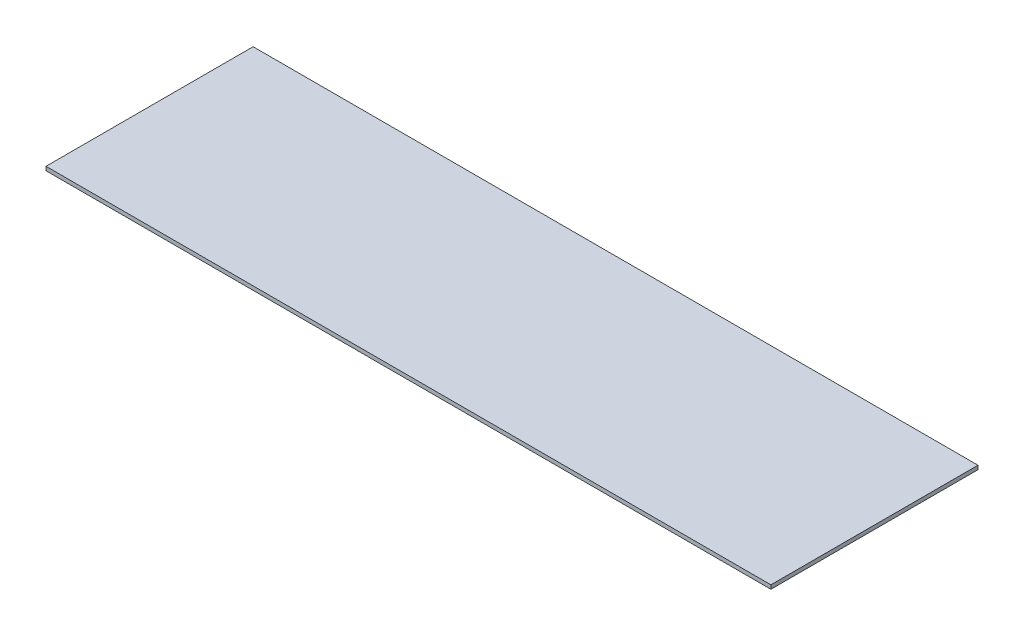
ISO-10303-21;
HEADER;
FILE_DESCRIPTION(('STEP AP214'),'2;1');
FILE_NAME('part.step','',(''),(''),'','','');
FILE_SCHEMA(('AUTOMOTIVE_DESIGN { 1 0 10303 214 1 1 1 1 }'));
ENDSEC;
DATA;
#1=APPLICATION_CONTEXT('core data for automotive mechanical design processes');
#2=APPLICATION_PROTOCOL_DEFINITION('international standard','automotive_design',2000,#1);
#3=PRODUCT_CONTEXT('',#1,'mechanical');
#4=PRODUCT('Part','Part','',(#3));
#5=PRODUCT_RELATED_PRODUCT_CATEGORY('part','',(#4));
#6=PRODUCT_DEFINITION_FORMATION('','',#4);
#7=PRODUCT_DEFINITION_CONTEXT('part definition',#1,'design');
#8=PRODUCT_DEFINITION('design','',#6,#7);
#9=PRODUCT_DEFINITION_SHAPE('','',#8);
#10=(LENGTH_UNIT() NAMED_UNIT(*) SI_UNIT(.MILLI.,.METRE.));
#11=(NAMED_UNIT(*) PLANE_ANGLE_UNIT() SI_UNIT($,.RADIAN.));
#12=(NAMED_UNIT(*) SI_UNIT($,.STERADIAN.) SOLID_ANGLE_UNIT());
#13=UNCERTAINTY_MEASURE_WITH_UNIT(LENGTH_MEASURE(1.E-05),#10,'distance_accuracy_value','');
#14=(GEOMETRIC_REPRESENTATION_CONTEXT(3) GLOBAL_UNCERTAINTY_ASSIGNED_CONTEXT((#13)) GLOBAL_UNIT_ASSIGNED_CONTEXT((#10,
#11,#12)) REPRESENTATION_CONTEXT('',''));
#15=CARTESIAN_POINT('',(0.,0.,0.));
#16=DIRECTION('',(0.,0.,1.));
#17=DIRECTION('',(1.,0.,0.));
#18=AXIS2_PLACEMENT_3D('',#15,#16,#17);
#19=CARTESIAN_POINT('',(14.,0.15,4.));
#20=DIRECTION('',(-1.,0.,0.));
#21=DIRECTION('',(0.,0.,1.));
#22=AXIS2_PLACEMENT_3D('',#19,#20,#21);
#23=PLANE('',#22);
#24=DIRECTION('',(0.,0.,-1.));
#25=VECTOR('',#24,1.);
#26=CARTESIAN_POINT('',(14.,0.,4.));
#27=LINE('',#26,#25);
#28=CARTESIAN_POINT('',(14.,0.,4.));
#29=VERTEX_POINT('',#28);
#30=CARTESIAN_POINT('',(14.,0.,-4.));
#31=VERTEX_POINT('',#30);
#32=EDGE_CURVE('E99',#29,#31,#27,.T.);
#33=ORIENTED_EDGE('',*,*,#32,.T.);
#34=DIRECTION('',(0.,-1.,0.));
#35=VECTOR('',#34,1.);
#36=CARTESIAN_POINT('',(14.,0.15,-4.));
#37=LINE('',#36,#35);
#38=CARTESIAN_POINT('',(14.,0.15,-4.));
#39=VERTEX_POINT('',#38);
#40=EDGE_CURVE('E11',#39,#31,#37,.T.);
#41=ORIENTED_EDGE('',*,*,#40,.F.);
#42=DIRECTION('',(0.,0.,-1.));
#43=VECTOR('',#42,1.);
#44=CARTESIAN_POINT('',(14.,0.15,4.));
#45=LINE('',#44,#43);
#46=CARTESIAN_POINT('',(14.,0.15,4.));
#47=VERTEX_POINT('',#46);
#48=EDGE_CURVE('E87',#47,#39,#45,.T.);
#49=ORIENTED_EDGE('',*,*,#48,.F.);
#50=DIRECTION('',(0.,-1.,0.));
#51=VECTOR('',#50,1.);
#52=CARTESIAN_POINT('',(14.,0.15,4.));
#53=LINE('',#52,#51);
#54=EDGE_CURVE('E95',#47,#29,#53,.T.);
#55=ORIENTED_EDGE('',*,*,#54,.T.);
#56=EDGE_LOOP('',(#33,#41,#49,#55));
#57=FACE_BOUND('',#56,.T.);
#58=ADVANCED_FACE('F36',(#57),#23,.F.);
#59=CARTESIAN_POINT('',(-14.,0.15,-4.));
#60=DIRECTION('',(0.,0.,1.));
#61=DIRECTION('',(1.,0.,0.));
#62=AXIS2_PLACEMENT_3D('',#59,#60,#61);
#63=PLANE('',#62);
#64=DIRECTION('',(-1.,0.,0.));
#65=VECTOR('',#64,1.);
#66=CARTESIAN_POINT('',(-14.,0.,-4.));
#67=LINE('',#66,#65);
#68=CARTESIAN_POINT('',(-14.,0.,-4.));
#69=VERTEX_POINT('',#68);
#70=EDGE_CURVE('E91',#31,#69,#67,.T.);
#71=ORIENTED_EDGE('',*,*,#70,.T.);
#72=DIRECTION('',(0.,-1.,0.));
#73=VECTOR('',#72,1.);
#74=CARTESIAN_POINT('',(-14.,0.15,-4.));
#75=LINE('',#74,#73);
#76=CARTESIAN_POINT('',(-14.,0.15,-4.));
#77=VERTEX_POINT('',#76);
#78=EDGE_CURVE('E44',#77,#69,#75,.T.);
#79=ORIENTED_EDGE('',*,*,#78,.F.);
#80=DIRECTION('',(-1.,0.,0.));
#81=VECTOR('',#80,1.);
#82=CARTESIAN_POINT('',(-14.,0.15,-4.));
#83=LINE('',#82,#81);
#84=EDGE_CURVE('E82',#39,#77,#83,.T.);
#85=ORIENTED_EDGE('',*,*,#84,.F.);
#86=ORIENTED_EDGE('',*,*,#40,.T.);
#87=EDGE_LOOP('',(#71,#79,#85,#86));
#88=FACE_BOUND('',#87,.T.);
#89=ADVANCED_FACE('F90',(#88),#63,.F.);
#90=CARTESIAN_POINT('',(-14.,0.15,4.));
#91=DIRECTION('',(1.,0.,0.));
#92=DIRECTION('',(0.,0.,-1.));
#93=AXIS2_PLACEMENT_3D('',#90,#91,#92);
#94=PLANE('',#93);
#95=DIRECTION('',(0.,0.,1.));
#96=VECTOR('',#95,1.);
#97=CARTESIAN_POINT('',(-14.,0.,4.));
#98=LINE('',#97,#96);
#99=CARTESIAN_POINT('',(-14.,0.,4.));
#100=VERTEX_POINT('',#99);
#101=EDGE_CURVE('E69',#69,#100,#98,.T.);
#102=ORIENTED_EDGE('',*,*,#101,.T.);
#103=DIRECTION('',(0.,-1.,0.));
#104=VECTOR('',#103,1.);
#105=CARTESIAN_POINT('',(-14.,0.15,4.));
#106=LINE('',#105,#104);
#107=CARTESIAN_POINT('',(-14.,0.15,4.));
#108=VERTEX_POINT('',#107);
#109=EDGE_CURVE('E92',#108,#100,#106,.T.);
#110=ORIENTED_EDGE('',*,*,#109,.F.);
#111=DIRECTION('',(0.,0.,1.));
#112=VECTOR('',#111,1.);
#113=CARTESIAN_POINT('',(-14.,0.15,4.));
#114=LINE('',#113,#112);
#115=EDGE_CURVE('E85',#77,#108,#114,.T.);
#116=ORIENTED_EDGE('',*,*,#115,.F.);
#117=ORIENTED_EDGE('',*,*,#78,.T.);
#118=EDGE_LOOP('',(#102,#110,#116,#117));
#119=FACE_BOUND('',#118,.T.);
#120=ADVANCED_FACE('F93',(#119),#94,.F.);
#121=CARTESIAN_POINT('',(-14.,0.15,4.));
#122=DIRECTION('',(0.,0.,-1.));
#123=DIRECTION('',(-1.,0.,0.));
#124=AXIS2_PLACEMENT_3D('',#121,#122,#123);
#125=PLANE('',#124);
#126=DIRECTION('',(1.,0.,0.));
#127=VECTOR('',#126,1.);
#128=CARTESIAN_POINT('',(-14.,0.,4.));
#129=LINE('',#128,#127);
#130=EDGE_CURVE('E75',#100,#29,#129,.T.);
#131=ORIENTED_EDGE('',*,*,#130,.T.);
#132=ORIENTED_EDGE('',*,*,#54,.F.);
#133=DIRECTION('',(1.,0.,0.));
#134=VECTOR('',#133,1.);
#135=CARTESIAN_POINT('',(-14.,0.15,4.));
#136=LINE('',#135,#134);
#137=EDGE_CURVE('E52',#108,#47,#136,.T.);
#138=ORIENTED_EDGE('',*,*,#137,.F.);
#139=ORIENTED_EDGE('',*,*,#109,.T.);
#140=EDGE_LOOP('',(#131,#132,#138,#139));
#141=FACE_BOUND('',#140,.T.);
#142=ADVANCED_FACE('F106',(#141),#125,.F.);
#143=CARTESIAN_POINT('',(0.,0.15,0.));
#144=DIRECTION('',(0.,-1.,0.));
#145=DIRECTION('',(0.,0.,-1.));
#146=AXIS2_PLACEMENT_3D('',#143,#144,#145);
#147=PLANE('',#146);
#148=ORIENTED_EDGE('',*,*,#48,.T.);
#149=ORIENTED_EDGE('',*,*,#84,.T.);
#150=ORIENTED_EDGE('',*,*,#115,.T.);
#151=ORIENTED_EDGE('',*,*,#137,.T.);
#152=EDGE_LOOP('',(#148,#149,#150,#151));
#153=FACE_BOUND('',#152,.T.);
#154=ADVANCED_FACE('F83',(#153),#147,.F.);
#155=CARTESIAN_POINT('',(0.,0.,0.));
#156=DIRECTION('',(0.,-1.,0.));
#157=DIRECTION('',(0.,0.,-1.));
#158=AXIS2_PLACEMENT_3D('',#155,#156,#157);
#159=PLANE('',#158);
#160=ORIENTED_EDGE('',*,*,#32,.F.);
#161=ORIENTED_EDGE('',*,*,#130,.F.);
#162=ORIENTED_EDGE('',*,*,#101,.F.);
#163=ORIENTED_EDGE('',*,*,#70,.F.);
#164=EDGE_LOOP('',(#160,#161,#162,#163));
#165=FACE_BOUND('',#164,.T.);
#166=ADVANCED_FACE('F109',(#165),#159,.T.);
#167=CLOSED_SHELL('',(#58,#89,#120,#142,#154,#166));
#168=MANIFOLD_SOLID_BREP('B2',#167);
#169=ADVANCED_BREP_SHAPE_REPRESENTATION('',(#18,#168),#14);
#170=SHAPE_DEFINITION_REPRESENTATION(#9,#169);
ENDSEC;
END-ISO-10303-21;
